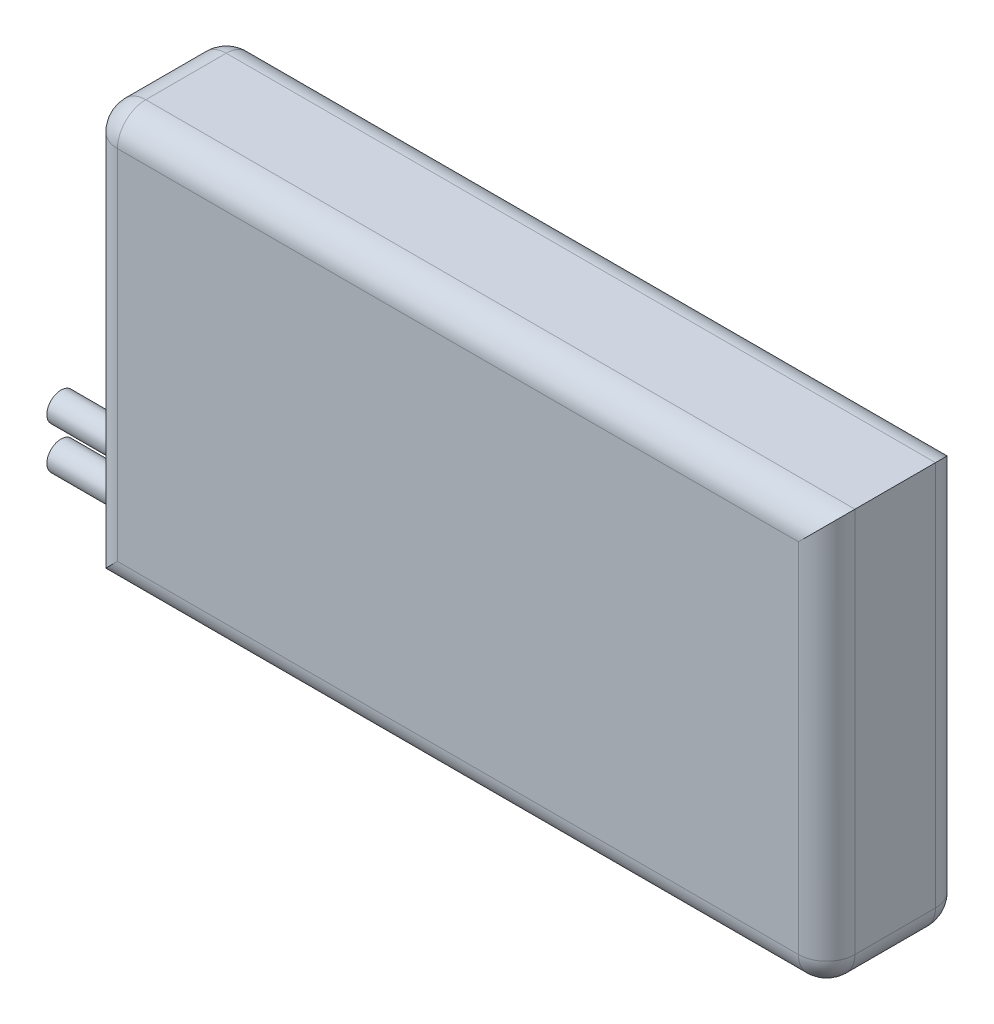
ISO-10303-21;
HEADER;
FILE_DESCRIPTION(('STEP AP214'),'2;1');
FILE_NAME('part.step','',(''),(''),'','','');
FILE_SCHEMA(('AUTOMOTIVE_DESIGN { 1 0 10303 214 1 1 1 1 }'));
ENDSEC;
DATA;
#1=APPLICATION_CONTEXT('core data for automotive mechanical design processes');
#2=APPLICATION_PROTOCOL_DEFINITION('international standard','automotive_design',2000,#1);
#3=PRODUCT_CONTEXT('',#1,'mechanical');
#4=PRODUCT('Part','Part','',(#3));
#5=PRODUCT_RELATED_PRODUCT_CATEGORY('part','',(#4));
#6=PRODUCT_DEFINITION_FORMATION('','',#4);
#7=PRODUCT_DEFINITION_CONTEXT('part definition',#1,'design');
#8=PRODUCT_DEFINITION('design','',#6,#7);
#9=PRODUCT_DEFINITION_SHAPE('','',#8);
#10=(LENGTH_UNIT() NAMED_UNIT(*) SI_UNIT(.MILLI.,.METRE.));
#11=(NAMED_UNIT(*) PLANE_ANGLE_UNIT() SI_UNIT($,.RADIAN.));
#12=(NAMED_UNIT(*) SI_UNIT($,.STERADIAN.) SOLID_ANGLE_UNIT());
#13=UNCERTAINTY_MEASURE_WITH_UNIT(LENGTH_MEASURE(1.E-05),#10,'distance_accuracy_value','');
#14=(GEOMETRIC_REPRESENTATION_CONTEXT(3) GLOBAL_UNCERTAINTY_ASSIGNED_CONTEXT((#13)) GLOBAL_UNIT_ASSIGNED_CONTEXT((#10,
#11,#12)) REPRESENTATION_CONTEXT('',''));
#15=CARTESIAN_POINT('',(0.,0.,0.));
#16=DIRECTION('',(0.,0.,1.));
#17=DIRECTION('',(1.,0.,0.));
#18=AXIS2_PLACEMENT_3D('',#15,#16,#17);
#19=CARTESIAN_POINT('',(24.1,-12.65,9.7));
#20=DIRECTION('',(0.,0.,-1.));
#21=DIRECTION('',(-1.,0.,0.));
#22=AXIS2_PLACEMENT_3D('',#19,#20,#21);
#23=CYLINDRICAL_SURFACE('',#22,2.);
#24=CARTESIAN_POINT('',(24.1,-12.65,2.));
#25=DIRECTION('',(0.,0.,-1.));
#26=DIRECTION('',(-1.,0.,0.));
#27=AXIS2_PLACEMENT_3D('',#24,#25,#26);
#28=CIRCLE('',#27,2.);
#29=CARTESIAN_POINT('',(26.1,-12.65,2.));
#30=VERTEX_POINT('',#29);
#31=CARTESIAN_POINT('',(24.1,-14.65,2.));
#32=VERTEX_POINT('',#31);
#33=EDGE_CURVE('E11',#30,#32,#28,.T.);
#34=ORIENTED_EDGE('',*,*,#33,.F.);
#35=DIRECTION('',(0.,0.,-1.));
#36=VECTOR('',#35,1.);
#37=CARTESIAN_POINT('',(26.1,-12.65,9.7));
#38=LINE('',#37,#36);
#39=CARTESIAN_POINT('',(26.1,-12.65,7.7));
#40=VERTEX_POINT('',#39);
#41=EDGE_CURVE('E208',#40,#30,#38,.T.);
#42=ORIENTED_EDGE('',*,*,#41,.F.);
#43=CARTESIAN_POINT('',(24.1,-12.65,7.7));
#44=DIRECTION('',(0.,0.,-1.));
#45=DIRECTION('',(-1.,0.,0.));
#46=AXIS2_PLACEMENT_3D('',#43,#44,#45);
#47=CIRCLE('',#46,2.);
#48=CARTESIAN_POINT('',(24.1,-14.65,7.7));
#49=VERTEX_POINT('',#48);
#50=EDGE_CURVE('E40',#40,#49,#47,.T.);
#51=ORIENTED_EDGE('',*,*,#50,.T.);
#52=DIRECTION('',(0.,0.,-1.));
#53=VECTOR('',#52,1.);
#54=CARTESIAN_POINT('',(24.1,-14.65,9.7));
#55=LINE('',#54,#53);
#56=EDGE_CURVE('E211',#32,#49,#55,.F.);
#57=ORIENTED_EDGE('',*,*,#56,.F.);
#58=EDGE_LOOP('',(#34,#42,#51,#57));
#59=FACE_BOUND('',#58,.T.);
#60=ADVANCED_FACE('F32',(#59),#23,.T.);
#61=CARTESIAN_POINT('',(24.1,-12.65,7.7));
#62=DIRECTION('',(0.,0.,1.));
#63=DIRECTION('',(1.,0.,0.));
#64=AXIS2_PLACEMENT_3D('',#61,#62,#63);
#65=SPHERICAL_SURFACE('',#64,2.);
#66=ORIENTED_EDGE('',*,*,#50,.F.);
#67=CARTESIAN_POINT('',(24.1,-12.65,7.7));
#68=DIRECTION('',(0.,-1.,0.));
#69=DIRECTION('',(0.,0.,-1.));
#70=AXIS2_PLACEMENT_3D('',#67,#68,#69);
#71=CIRCLE('',#70,2.);
#72=CARTESIAN_POINT('',(24.1,-12.65,9.7));
#73=VERTEX_POINT('',#72);
#74=EDGE_CURVE('E203',#73,#40,#71,.F.);
#75=ORIENTED_EDGE('',*,*,#74,.F.);
#76=CARTESIAN_POINT('',(24.1,-12.65,7.7));
#77=DIRECTION('',(-1.,0.,0.));
#78=DIRECTION('',(0.,-1.,0.));
#79=AXIS2_PLACEMENT_3D('',#76,#77,#78);
#80=CIRCLE('',#79,2.);
#81=EDGE_CURVE('E206',#49,#73,#80,.T.);
#82=ORIENTED_EDGE('',*,*,#81,.F.);
#83=EDGE_LOOP('',(#66,#75,#82));
#84=FACE_BOUND('',#83,.T.);
#85=ADVANCED_FACE('F226',(#84),#65,.T.);
#86=CARTESIAN_POINT('',(24.1,-12.65,2.));
#87=DIRECTION('',(0.,0.,1.));
#88=DIRECTION('',(1.,0.,0.));
#89=AXIS2_PLACEMENT_3D('',#86,#87,#88);
#90=SPHERICAL_SURFACE('',#89,2.);
#91=CARTESIAN_POINT('',(24.1,-12.65,2.));
#92=DIRECTION('',(0.,-1.,0.));
#93=DIRECTION('',(0.,0.,-1.));
#94=AXIS2_PLACEMENT_3D('',#91,#92,#93);
#95=CIRCLE('',#94,2.);
#96=CARTESIAN_POINT('',(24.1,-12.65,0.));
#97=VERTEX_POINT('',#96);
#98=EDGE_CURVE('E214',#30,#97,#95,.F.);
#99=ORIENTED_EDGE('',*,*,#98,.F.);
#100=ORIENTED_EDGE('',*,*,#33,.T.);
#101=CARTESIAN_POINT('',(24.1,-12.65,2.));
#102=DIRECTION('',(-1.,0.,0.));
#103=DIRECTION('',(0.,-1.,0.));
#104=AXIS2_PLACEMENT_3D('',#101,#102,#103);
#105=CIRCLE('',#104,2.);
#106=EDGE_CURVE('E217',#97,#32,#105,.T.);
#107=ORIENTED_EDGE('',*,*,#106,.F.);
#108=EDGE_LOOP('',(#99,#100,#107));
#109=FACE_BOUND('',#108,.T.);
#110=ADVANCED_FACE('F34',(#109),#90,.T.);
#111=CARTESIAN_POINT('',(-24.1,12.65,9.7));
#112=DIRECTION('',(0.,0.,-1.));
#113=DIRECTION('',(-1.,0.,0.));
#114=AXIS2_PLACEMENT_3D('',#111,#112,#113);
#115=CYLINDRICAL_SURFACE('',#114,2.);
#116=CARTESIAN_POINT('',(-24.1,12.65,2.));
#117=DIRECTION('',(0.,0.,-1.));
#118=DIRECTION('',(-1.,0.,0.));
#119=AXIS2_PLACEMENT_3D('',#116,#117,#118);
#120=CIRCLE('',#119,2.);
#121=CARTESIAN_POINT('',(-26.1,12.65,2.));
#122=VERTEX_POINT('',#121);
#123=CARTESIAN_POINT('',(-24.1,14.65,2.));
#124=VERTEX_POINT('',#123);
#125=EDGE_CURVE('E201',#122,#124,#120,.T.);
#126=ORIENTED_EDGE('',*,*,#125,.F.);
#127=DIRECTION('',(0.,0.,-1.));
#128=VECTOR('',#127,1.);
#129=CARTESIAN_POINT('',(-26.1,12.65,9.7));
#130=LINE('',#129,#128);
#131=CARTESIAN_POINT('',(-26.1,12.65,7.7));
#132=VERTEX_POINT('',#131);
#133=EDGE_CURVE('E115',#132,#122,#130,.T.);
#134=ORIENTED_EDGE('',*,*,#133,.F.);
#135=CARTESIAN_POINT('',(-24.1,12.65,7.7));
#136=DIRECTION('',(0.,0.,-1.));
#137=DIRECTION('',(-1.,0.,0.));
#138=AXIS2_PLACEMENT_3D('',#135,#136,#137);
#139=CIRCLE('',#138,2.);
#140=CARTESIAN_POINT('',(-24.1,14.65,7.7));
#141=VERTEX_POINT('',#140);
#142=EDGE_CURVE('E120',#132,#141,#139,.T.);
#143=ORIENTED_EDGE('',*,*,#142,.T.);
#144=DIRECTION('',(0.,0.,-1.));
#145=VECTOR('',#144,1.);
#146=CARTESIAN_POINT('',(-24.1,14.65,9.7));
#147=LINE('',#146,#145);
#148=EDGE_CURVE('E191',#124,#141,#147,.F.);
#149=ORIENTED_EDGE('',*,*,#148,.F.);
#150=EDGE_LOOP('',(#126,#134,#143,#149));
#151=FACE_BOUND('',#150,.T.);
#152=ADVANCED_FACE('F287',(#151),#115,.T.);
#153=CARTESIAN_POINT('',(-24.1,12.65,7.7));
#154=DIRECTION('',(0.,0.,1.));
#155=DIRECTION('',(1.,0.,0.));
#156=AXIS2_PLACEMENT_3D('',#153,#154,#155);
#157=SPHERICAL_SURFACE('',#156,2.);
#158=ORIENTED_EDGE('',*,*,#142,.F.);
#159=CARTESIAN_POINT('',(-24.1,12.65,7.7));
#160=DIRECTION('',(0.,1.,0.));
#161=DIRECTION('',(0.,0.,1.));
#162=AXIS2_PLACEMENT_3D('',#159,#160,#161);
#163=CIRCLE('',#162,2.);
#164=CARTESIAN_POINT('',(-24.1,12.65,9.7));
#165=VERTEX_POINT('',#164);
#166=EDGE_CURVE('E116',#165,#132,#163,.F.);
#167=ORIENTED_EDGE('',*,*,#166,.F.);
#168=CARTESIAN_POINT('',(-24.1,12.65,7.7));
#169=DIRECTION('',(1.,0.,0.));
#170=DIRECTION('',(0.,1.,0.));
#171=AXIS2_PLACEMENT_3D('',#168,#169,#170);
#172=CIRCLE('',#171,2.);
#173=EDGE_CURVE('E107',#141,#165,#172,.T.);
#174=ORIENTED_EDGE('',*,*,#173,.F.);
#175=EDGE_LOOP('',(#158,#167,#174));
#176=FACE_BOUND('',#175,.T.);
#177=ADVANCED_FACE('F119',(#176),#157,.T.);
#178=CARTESIAN_POINT('',(-24.1,12.65,2.));
#179=DIRECTION('',(0.,0.,1.));
#180=DIRECTION('',(1.,0.,0.));
#181=AXIS2_PLACEMENT_3D('',#178,#179,#180);
#182=SPHERICAL_SURFACE('',#181,2.);
#183=CARTESIAN_POINT('',(-24.1,12.65,2.));
#184=DIRECTION('',(0.,1.,0.));
#185=DIRECTION('',(0.,0.,1.));
#186=AXIS2_PLACEMENT_3D('',#183,#184,#185);
#187=CIRCLE('',#186,2.);
#188=CARTESIAN_POINT('',(-24.1,12.65,0.));
#189=VERTEX_POINT('',#188);
#190=EDGE_CURVE('E194',#122,#189,#187,.F.);
#191=ORIENTED_EDGE('',*,*,#190,.F.);
#192=ORIENTED_EDGE('',*,*,#125,.T.);
#193=CARTESIAN_POINT('',(-24.1,12.65,2.));
#194=DIRECTION('',(1.,0.,0.));
#195=DIRECTION('',(0.,1.,0.));
#196=AXIS2_PLACEMENT_3D('',#193,#194,#195);
#197=CIRCLE('',#196,2.);
#198=EDGE_CURVE('E197',#189,#124,#197,.T.);
#199=ORIENTED_EDGE('',*,*,#198,.F.);
#200=EDGE_LOOP('',(#191,#192,#199));
#201=FACE_BOUND('',#200,.T.);
#202=ADVANCED_FACE('F282',(#201),#182,.T.);
#203=CARTESIAN_POINT('',(24.1,0.,2.));
#204=DIRECTION('',(0.,-1.,0.));
#205=DIRECTION('',(0.,0.,-1.));
#206=AXIS2_PLACEMENT_3D('',#203,#204,#205);
#207=CYLINDRICAL_SURFACE('',#206,2.);
#208=DIRECTION('',(0.,-1.,0.));
#209=VECTOR('',#208,1.);
#210=CARTESIAN_POINT('',(26.1,-14.65,2.));
#211=LINE('',#210,#209);
#212=CARTESIAN_POINT('',(26.1,14.65,2.));
#213=VERTEX_POINT('',#212);
#214=EDGE_CURVE('E182',#30,#213,#211,.F.);
#215=ORIENTED_EDGE('',*,*,#214,.F.);
#216=ORIENTED_EDGE('',*,*,#98,.T.);
#217=DIRECTION('',(0.,-1.,0.));
#218=VECTOR('',#217,1.);
#219=CARTESIAN_POINT('',(24.1,0.,0.));
#220=LINE('',#219,#218);
#221=CARTESIAN_POINT('',(24.1,12.65,0.));
#222=VERTEX_POINT('',#221);
#223=EDGE_CURVE('E162',#222,#97,#220,.T.);
#224=ORIENTED_EDGE('',*,*,#223,.F.);
#225=CARTESIAN_POINT('',(24.1,12.65,2.));
#226=DIRECTION('',(0.707106781186548,-0.707106781186547,0.));
#227=DIRECTION('',(-0.707106781186547,-0.707106781186548,0.));
#228=AXIS2_PLACEMENT_3D('',#225,#226,#227);
#229=ELLIPSE('',#228,2.82842712474619,2.);
#230=EDGE_CURVE('E126',#222,#213,#229,.T.);
#231=ORIENTED_EDGE('',*,*,#230,.T.);
#232=EDGE_LOOP('',(#215,#216,#224,#231));
#233=FACE_BOUND('',#232,.T.);
#234=ADVANCED_FACE('F285',(#233),#207,.T.);
#235=CARTESIAN_POINT('',(0.,12.65,2.));
#236=DIRECTION('',(1.,0.,0.));
#237=DIRECTION('',(0.,1.,0.));
#238=AXIS2_PLACEMENT_3D('',#235,#236,#237);
#239=CYLINDRICAL_SURFACE('',#238,2.);
#240=DIRECTION('',(1.,0.,0.));
#241=VECTOR('',#240,1.);
#242=CARTESIAN_POINT('',(0.,12.65,0.));
#243=LINE('',#242,#241);
#244=EDGE_CURVE('E165',#189,#222,#243,.T.);
#245=ORIENTED_EDGE('',*,*,#244,.F.);
#246=ORIENTED_EDGE('',*,*,#198,.T.);
#247=DIRECTION('',(1.,0.,0.));
#248=VECTOR('',#247,1.);
#249=CARTESIAN_POINT('',(26.1,14.65,2.));
#250=LINE('',#249,#248);
#251=EDGE_CURVE('E179',#213,#124,#250,.F.);
#252=ORIENTED_EDGE('',*,*,#251,.F.);
#253=ORIENTED_EDGE('',*,*,#230,.F.);
#254=EDGE_LOOP('',(#245,#246,#252,#253));
#255=FACE_BOUND('',#254,.T.);
#256=ADVANCED_FACE('F295',(#255),#239,.T.);
#257=CARTESIAN_POINT('',(-24.1,0.,2.));
#258=DIRECTION('',(0.,1.,0.));
#259=DIRECTION('',(0.,0.,1.));
#260=AXIS2_PLACEMENT_3D('',#257,#258,#259);
#261=CYLINDRICAL_SURFACE('',#260,2.);
#262=DIRECTION('',(0.,1.,0.));
#263=VECTOR('',#262,1.);
#264=CARTESIAN_POINT('',(-26.1,-14.65,2.));
#265=LINE('',#264,#263);
#266=CARTESIAN_POINT('',(-26.1,-14.65,2.));
#267=VERTEX_POINT('',#266);
#268=EDGE_CURVE('E177',#122,#267,#265,.F.);
#269=ORIENTED_EDGE('',*,*,#268,.F.);
#270=ORIENTED_EDGE('',*,*,#190,.T.);
#271=DIRECTION('',(0.,1.,0.));
#272=VECTOR('',#271,1.);
#273=CARTESIAN_POINT('',(-24.1,0.,0.));
#274=LINE('',#273,#272);
#275=CARTESIAN_POINT('',(-24.1,-12.65,0.));
#276=VERTEX_POINT('',#275);
#277=EDGE_CURVE('E168',#276,#189,#274,.T.);
#278=ORIENTED_EDGE('',*,*,#277,.F.);
#279=CARTESIAN_POINT('',(-24.1,-12.65,2.));
#280=DIRECTION('',(-0.707106781186548,0.707106781186547,0.));
#281=DIRECTION('',(0.707106781186547,0.707106781186548,0.));
#282=AXIS2_PLACEMENT_3D('',#279,#280,#281);
#283=ELLIPSE('',#282,2.82842712474619,2.);
#284=EDGE_CURVE('E184',#276,#267,#283,.T.);
#285=ORIENTED_EDGE('',*,*,#284,.T.);
#286=EDGE_LOOP('',(#269,#270,#278,#285));
#287=FACE_BOUND('',#286,.T.);
#288=ADVANCED_FACE('F299',(#287),#261,.T.);
#289=CARTESIAN_POINT('',(0.,-12.65,2.));
#290=DIRECTION('',(-1.,0.,0.));
#291=DIRECTION('',(0.,-1.,0.));
#292=AXIS2_PLACEMENT_3D('',#289,#290,#291);
#293=CYLINDRICAL_SURFACE('',#292,2.);
#294=DIRECTION('',(-1.,0.,0.));
#295=VECTOR('',#294,1.);
#296=CARTESIAN_POINT('',(0.,-12.65,0.));
#297=LINE('',#296,#295);
#298=EDGE_CURVE('E171',#97,#276,#297,.T.);
#299=ORIENTED_EDGE('',*,*,#298,.F.);
#300=ORIENTED_EDGE('',*,*,#106,.T.);
#301=DIRECTION('',(-1.,0.,0.));
#302=VECTOR('',#301,1.);
#303=CARTESIAN_POINT('',(26.1,-14.65,2.));
#304=LINE('',#303,#302);
#305=EDGE_CURVE('E174',#267,#32,#304,.F.);
#306=ORIENTED_EDGE('',*,*,#305,.F.);
#307=ORIENTED_EDGE('',*,*,#284,.F.);
#308=EDGE_LOOP('',(#299,#300,#306,#307));
#309=FACE_BOUND('',#308,.T.);
#310=ADVANCED_FACE('F303',(#309),#293,.T.);
#311=CARTESIAN_POINT('',(-24.1,0.,7.7));
#312=DIRECTION('',(0.,1.,0.));
#313=DIRECTION('',(0.,0.,1.));
#314=AXIS2_PLACEMENT_3D('',#311,#312,#313);
#315=CYLINDRICAL_SURFACE('',#314,2.);
#316=DIRECTION('',(0.,-1.,0.));
#317=VECTOR('',#316,1.);
#318=CARTESIAN_POINT('',(-24.1,0.,9.7));
#319=LINE('',#318,#317);
#320=CARTESIAN_POINT('',(-24.1,-12.65,9.7));
#321=VERTEX_POINT('',#320);
#322=EDGE_CURVE('E133',#165,#321,#319,.T.);
#323=ORIENTED_EDGE('',*,*,#322,.F.);
#324=ORIENTED_EDGE('',*,*,#166,.T.);
#325=DIRECTION('',(0.,-1.,0.));
#326=VECTOR('',#325,1.);
#327=CARTESIAN_POINT('',(-26.1,0.,7.7));
#328=LINE('',#327,#326);
#329=CARTESIAN_POINT('',(-26.1,-14.65,7.7));
#330=VERTEX_POINT('',#329);
#331=EDGE_CURVE('E157',#330,#132,#328,.F.);
#332=ORIENTED_EDGE('',*,*,#331,.F.);
#333=CARTESIAN_POINT('',(-24.1,-12.65,7.7));
#334=DIRECTION('',(-0.707106781186548,0.707106781186547,0.));
#335=DIRECTION('',(-0.707106781186547,-0.707106781186548,0.));
#336=AXIS2_PLACEMENT_3D('',#333,#334,#335);
#337=ELLIPSE('',#336,2.82842712474619,2.);
#338=EDGE_CURVE('E139',#321,#330,#337,.F.);
#339=ORIENTED_EDGE('',*,*,#338,.F.);
#340=EDGE_LOOP('',(#323,#324,#332,#339));
#341=FACE_BOUND('',#340,.T.);
#342=ADVANCED_FACE('F137',(#341),#315,.T.);
#343=CARTESIAN_POINT('',(0.,12.65,7.7));
#344=DIRECTION('',(1.,0.,0.));
#345=DIRECTION('',(0.,1.,0.));
#346=AXIS2_PLACEMENT_3D('',#343,#344,#345);
#347=CYLINDRICAL_SURFACE('',#346,2.);
#348=DIRECTION('',(-1.,0.,0.));
#349=VECTOR('',#348,1.);
#350=CARTESIAN_POINT('',(0.,14.65,7.7));
#351=LINE('',#350,#349);
#352=CARTESIAN_POINT('',(26.1,14.65,7.7));
#353=VERTEX_POINT('',#352);
#354=EDGE_CURVE('E113',#141,#353,#351,.F.);
#355=ORIENTED_EDGE('',*,*,#354,.F.);
#356=ORIENTED_EDGE('',*,*,#173,.T.);
#357=DIRECTION('',(-1.,0.,0.));
#358=VECTOR('',#357,1.);
#359=CARTESIAN_POINT('',(0.,12.65,9.7));
#360=LINE('',#359,#358);
#361=CARTESIAN_POINT('',(24.1,12.65,9.7));
#362=VERTEX_POINT('',#361);
#363=EDGE_CURVE('E112',#362,#165,#360,.T.);
#364=ORIENTED_EDGE('',*,*,#363,.F.);
#365=CARTESIAN_POINT('',(24.1,12.65,7.7));
#366=DIRECTION('',(0.707106781186548,-0.707106781186547,0.));
#367=DIRECTION('',(0.707106781186547,0.707106781186548,0.));
#368=AXIS2_PLACEMENT_3D('',#365,#366,#367);
#369=ELLIPSE('',#368,2.82842712474619,2.);
#370=EDGE_CURVE('E159',#362,#353,#369,.F.);
#371=ORIENTED_EDGE('',*,*,#370,.T.);
#372=EDGE_LOOP('',(#355,#356,#364,#371));
#373=FACE_BOUND('',#372,.T.);
#374=ADVANCED_FACE('F109',(#373),#347,.T.);
#375=CARTESIAN_POINT('',(24.1,0.,7.7));
#376=DIRECTION('',(0.,-1.,0.));
#377=DIRECTION('',(0.,0.,-1.));
#378=AXIS2_PLACEMENT_3D('',#375,#376,#377);
#379=CYLINDRICAL_SURFACE('',#378,2.);
#380=DIRECTION('',(0.,1.,0.));
#381=VECTOR('',#380,1.);
#382=CARTESIAN_POINT('',(24.1,0.,9.7));
#383=LINE('',#382,#381);
#384=EDGE_CURVE('E135',#73,#362,#383,.T.);
#385=ORIENTED_EDGE('',*,*,#384,.F.);
#386=ORIENTED_EDGE('',*,*,#74,.T.);
#387=DIRECTION('',(0.,1.,0.));
#388=VECTOR('',#387,1.);
#389=CARTESIAN_POINT('',(26.1,0.,7.7));
#390=LINE('',#389,#388);
#391=EDGE_CURVE('E153',#353,#40,#390,.F.);
#392=ORIENTED_EDGE('',*,*,#391,.F.);
#393=ORIENTED_EDGE('',*,*,#370,.F.);
#394=EDGE_LOOP('',(#385,#386,#392,#393));
#395=FACE_BOUND('',#394,.T.);
#396=ADVANCED_FACE('F312',(#395),#379,.T.);
#397=CARTESIAN_POINT('',(0.,-12.65,7.7));
#398=DIRECTION('',(-1.,0.,0.));
#399=DIRECTION('',(0.,-1.,0.));
#400=AXIS2_PLACEMENT_3D('',#397,#398,#399);
#401=CYLINDRICAL_SURFACE('',#400,2.);
#402=DIRECTION('',(1.,0.,0.));
#403=VECTOR('',#402,1.);
#404=CARTESIAN_POINT('',(0.,-14.65,7.7));
#405=LINE('',#404,#403);
#406=EDGE_CURVE('E151',#49,#330,#405,.F.);
#407=ORIENTED_EDGE('',*,*,#406,.F.);
#408=ORIENTED_EDGE('',*,*,#81,.T.);
#409=DIRECTION('',(1.,0.,0.));
#410=VECTOR('',#409,1.);
#411=CARTESIAN_POINT('',(0.,-12.65,9.7));
#412=LINE('',#411,#410);
#413=EDGE_CURVE('E149',#321,#73,#412,.T.);
#414=ORIENTED_EDGE('',*,*,#413,.F.);
#415=ORIENTED_EDGE('',*,*,#338,.T.);
#416=EDGE_LOOP('',(#407,#408,#414,#415));
#417=FACE_BOUND('',#416,.T.);
#418=ADVANCED_FACE('F228',(#417),#401,.T.);
#419=CARTESIAN_POINT('',(-26.1,-14.65,9.7));
#420=DIRECTION('',(1.,0.,0.));
#421=DIRECTION('',(0.,0.,-1.));
#422=AXIS2_PLACEMENT_3D('',#419,#420,#421);
#423=PLANE('',#422);
#424=CARTESIAN_POINT('',(-26.1,-10.15,4.7));
#425=DIRECTION('',(1.,0.,0.));
#426=DIRECTION('',(0.,0.,-1.));
#427=AXIS2_PLACEMENT_3D('',#424,#425,#426);
#428=CIRCLE('',#427,1.);
#429=CARTESIAN_POINT('',(-26.1,-10.15,3.7));
#430=VERTEX_POINT('',#429);
#431=EDGE_CURVE('E141',#430,#430,#428,.F.);
#432=ORIENTED_EDGE('',*,*,#431,.F.);
#433=EDGE_LOOP('',(#432));
#434=FACE_BOUND('',#433,.T.);
#435=CARTESIAN_POINT('',(-26.1,-13.15,4.7));
#436=DIRECTION('',(1.,0.,0.));
#437=DIRECTION('',(0.,0.,-1.));
#438=AXIS2_PLACEMENT_3D('',#435,#436,#437);
#439=CIRCLE('',#438,1.);
#440=CARTESIAN_POINT('',(-26.1,-13.15,3.7));
#441=VERTEX_POINT('',#440);
#442=EDGE_CURVE('E144',#441,#441,#439,.F.);
#443=ORIENTED_EDGE('',*,*,#442,.F.);
#444=EDGE_LOOP('',(#443));
#445=FACE_BOUND('',#444,.T.);
#446=ORIENTED_EDGE('',*,*,#331,.T.);
#447=ORIENTED_EDGE('',*,*,#133,.T.);
#448=ORIENTED_EDGE('',*,*,#268,.T.);
#449=DIRECTION('',(0.,0.,-1.));
#450=VECTOR('',#449,1.);
#451=CARTESIAN_POINT('',(-26.1,-14.65,9.7));
#452=LINE('',#451,#450);
#453=EDGE_CURVE('E231',#330,#267,#452,.T.);
#454=ORIENTED_EDGE('',*,*,#453,.F.);
#455=EDGE_LOOP('',(#446,#447,#448,#454));
#456=FACE_BOUND('',#455,.T.);
#457=ADVANCED_FACE('F232',(#434,#445,#456),#423,.F.);
#458=CARTESIAN_POINT('',(26.1,-14.65,9.7));
#459=DIRECTION('',(0.,1.,0.));
#460=DIRECTION('',(-1.,0.,0.));
#461=AXIS2_PLACEMENT_3D('',#458,#459,#460);
#462=PLANE('',#461);
#463=ORIENTED_EDGE('',*,*,#305,.T.);
#464=ORIENTED_EDGE('',*,*,#56,.T.);
#465=ORIENTED_EDGE('',*,*,#406,.T.);
#466=ORIENTED_EDGE('',*,*,#453,.T.);
#467=EDGE_LOOP('',(#463,#464,#465,#466));
#468=FACE_BOUND('',#467,.T.);
#469=ADVANCED_FACE('F222',(#468),#462,.F.);
#470=CARTESIAN_POINT('',(26.1,-14.65,9.7));
#471=DIRECTION('',(-1.,0.,0.));
#472=DIRECTION('',(0.,0.,1.));
#473=AXIS2_PLACEMENT_3D('',#470,#471,#472);
#474=PLANE('',#473);
#475=ORIENTED_EDGE('',*,*,#391,.T.);
#476=ORIENTED_EDGE('',*,*,#41,.T.);
#477=ORIENTED_EDGE('',*,*,#214,.T.);
#478=DIRECTION('',(0.,0.,-1.));
#479=VECTOR('',#478,1.);
#480=CARTESIAN_POINT('',(26.1,14.65,9.7));
#481=LINE('',#480,#479);
#482=EDGE_CURVE('E234',#353,#213,#481,.T.);
#483=ORIENTED_EDGE('',*,*,#482,.F.);
#484=EDGE_LOOP('',(#475,#476,#477,#483));
#485=FACE_BOUND('',#484,.T.);
#486=ADVANCED_FACE('F320',(#485),#474,.F.);
#487=CARTESIAN_POINT('',(26.1,14.65,9.7));
#488=DIRECTION('',(0.,-1.,0.));
#489=DIRECTION('',(1.,0.,0.));
#490=AXIS2_PLACEMENT_3D('',#487,#488,#489);
#491=PLANE('',#490);
#492=ORIENTED_EDGE('',*,*,#251,.T.);
#493=ORIENTED_EDGE('',*,*,#148,.T.);
#494=ORIENTED_EDGE('',*,*,#354,.T.);
#495=ORIENTED_EDGE('',*,*,#482,.T.);
#496=EDGE_LOOP('',(#492,#493,#494,#495));
#497=FACE_BOUND('',#496,.T.);
#498=ADVANCED_FACE('F323',(#497),#491,.F.);
#499=CARTESIAN_POINT('',(0.,0.,9.7));
#500=DIRECTION('',(0.,0.,1.));
#501=DIRECTION('',(1.,0.,0.));
#502=AXIS2_PLACEMENT_3D('',#499,#500,#501);
#503=PLANE('',#502);
#504=ORIENTED_EDGE('',*,*,#322,.T.);
#505=ORIENTED_EDGE('',*,*,#413,.T.);
#506=ORIENTED_EDGE('',*,*,#384,.T.);
#507=ORIENTED_EDGE('',*,*,#363,.T.);
#508=EDGE_LOOP('',(#504,#505,#506,#507));
#509=FACE_BOUND('',#508,.T.);
#510=ADVANCED_FACE('F131',(#509),#503,.T.);
#511=CARTESIAN_POINT('',(0.,0.,0.));
#512=DIRECTION('',(0.,0.,1.));
#513=DIRECTION('',(1.,0.,0.));
#514=AXIS2_PLACEMENT_3D('',#511,#512,#513);
#515=PLANE('',#514);
#516=ORIENTED_EDGE('',*,*,#223,.T.);
#517=ORIENTED_EDGE('',*,*,#298,.T.);
#518=ORIENTED_EDGE('',*,*,#277,.T.);
#519=ORIENTED_EDGE('',*,*,#244,.T.);
#520=EDGE_LOOP('',(#516,#517,#518,#519));
#521=FACE_BOUND('',#520,.T.);
#522=ADVANCED_FACE('F263',(#521),#515,.F.);
#523=CARTESIAN_POINT('',(-33.1,-13.15,4.7));
#524=DIRECTION('',(1.,0.,0.));
#525=DIRECTION('',(0.,0.,-1.));
#526=AXIS2_PLACEMENT_3D('',#523,#524,#525);
#527=CYLINDRICAL_SURFACE('',#526,1.);
#528=CARTESIAN_POINT('',(-33.1,-13.15,4.7));
#529=DIRECTION('',(-1.,0.,0.));
#530=DIRECTION('',(0.,0.,1.));
#531=AXIS2_PLACEMENT_3D('',#528,#529,#530);
#532=CIRCLE('',#531,1.);
#533=CARTESIAN_POINT('',(-33.1,-13.15,5.7));
#534=VERTEX_POINT('',#533);
#535=EDGE_CURVE('E238',#534,#534,#532,.T.);
#536=ORIENTED_EDGE('',*,*,#535,.F.);
#537=EDGE_LOOP('',(#536));
#538=FACE_BOUND('',#537,.T.);
#539=ORIENTED_EDGE('',*,*,#442,.T.);
#540=EDGE_LOOP('',(#539));
#541=FACE_BOUND('',#540,.T.);
#542=ADVANCED_FACE('F261',(#538,#541),#527,.T.);
#543=CARTESIAN_POINT('',(-33.1,-13.15,4.7));
#544=DIRECTION('',(-1.,0.,0.));
#545=DIRECTION('',(0.,0.,1.));
#546=AXIS2_PLACEMENT_3D('',#543,#544,#545);
#547=PLANE('',#546);
#548=ORIENTED_EDGE('',*,*,#535,.T.);
#549=EDGE_LOOP('',(#548));
#550=FACE_BOUND('',#549,.T.);
#551=ADVANCED_FACE('F252',(#550),#547,.T.);
#552=CARTESIAN_POINT('',(-33.1,-10.15,4.7));
#553=DIRECTION('',(1.,0.,0.));
#554=DIRECTION('',(0.,0.,-1.));
#555=AXIS2_PLACEMENT_3D('',#552,#553,#554);
#556=CYLINDRICAL_SURFACE('',#555,1.);
#557=CARTESIAN_POINT('',(-33.1,-10.15,4.7));
#558=DIRECTION('',(-1.,0.,0.));
#559=DIRECTION('',(0.,0.,1.));
#560=AXIS2_PLACEMENT_3D('',#557,#558,#559);
#561=CIRCLE('',#560,1.);
#562=CARTESIAN_POINT('',(-33.1,-10.15,5.7));
#563=VERTEX_POINT('',#562);
#564=EDGE_CURVE('E243',#563,#563,#561,.T.);
#565=ORIENTED_EDGE('',*,*,#564,.F.);
#566=EDGE_LOOP('',(#565));
#567=FACE_BOUND('',#566,.T.);
#568=ORIENTED_EDGE('',*,*,#431,.T.);
#569=EDGE_LOOP('',(#568));
#570=FACE_BOUND('',#569,.T.);
#571=ADVANCED_FACE('F249',(#567,#570),#556,.T.);
#572=CARTESIAN_POINT('',(-33.1,-10.15,4.7));
#573=DIRECTION('',(-1.,0.,0.));
#574=DIRECTION('',(0.,0.,1.));
#575=AXIS2_PLACEMENT_3D('',#572,#573,#574);
#576=PLANE('',#575);
#577=ORIENTED_EDGE('',*,*,#564,.T.);
#578=EDGE_LOOP('',(#577));
#579=FACE_BOUND('',#578,.T.);
#580=ADVANCED_FACE('F247',(#579),#576,.T.);
#581=CLOSED_SHELL('',(#60,#85,#110,#152,#177,#202,#234,#256,#288,#310,#342,#374,#396,#418,#457,
#469,#486,#498,#510,#522,#542,#551,#571,#580));
#582=MANIFOLD_SOLID_BREP('B2',#581);
#583=ADVANCED_BREP_SHAPE_REPRESENTATION('',(#18,#582),#14);
#584=SHAPE_DEFINITION_REPRESENTATION(#9,#583);
ENDSEC;
END-ISO-10303-21;
